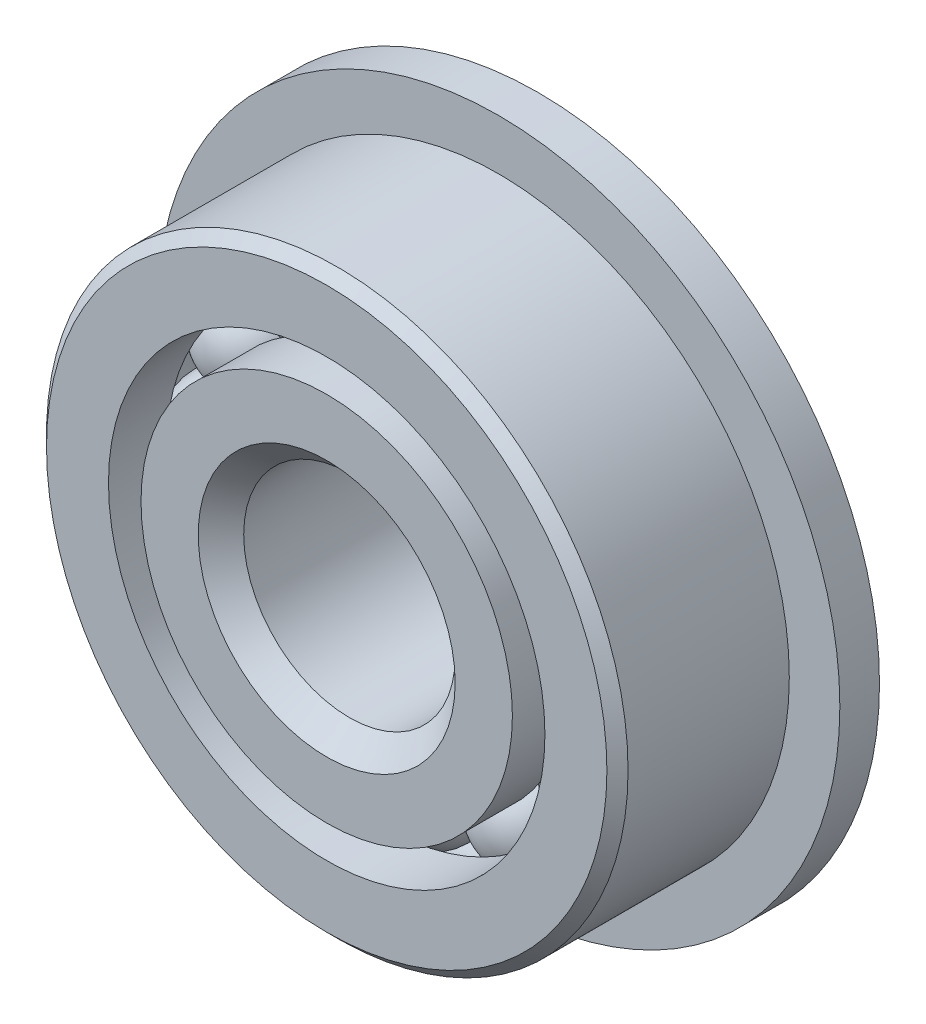
ISO-10303-21;
HEADER;
FILE_DESCRIPTION(('STEP AP214'),'2;1');
FILE_NAME('part.step','',(''),(''),'','','');
FILE_SCHEMA(('AUTOMOTIVE_DESIGN { 1 0 10303 214 1 1 1 1 }'));
ENDSEC;
DATA;
#1=APPLICATION_CONTEXT('core data for automotive mechanical design processes');
#2=APPLICATION_PROTOCOL_DEFINITION('international standard','automotive_design',2000,#1);
#3=PRODUCT_CONTEXT('',#1,'mechanical');
#4=PRODUCT('Part','Part','',(#3));
#5=PRODUCT_RELATED_PRODUCT_CATEGORY('part','',(#4));
#6=PRODUCT_DEFINITION_FORMATION('','',#4);
#7=PRODUCT_DEFINITION_CONTEXT('part definition',#1,'design');
#8=PRODUCT_DEFINITION('design','',#6,#7);
#9=PRODUCT_DEFINITION_SHAPE('','',#8);
#10=(LENGTH_UNIT() NAMED_UNIT(*) SI_UNIT(.MILLI.,.METRE.));
#11=(NAMED_UNIT(*) PLANE_ANGLE_UNIT() SI_UNIT($,.RADIAN.));
#12=(NAMED_UNIT(*) SI_UNIT($,.STERADIAN.) SOLID_ANGLE_UNIT());
#13=UNCERTAINTY_MEASURE_WITH_UNIT(LENGTH_MEASURE(1.E-05),#10,'distance_accuracy_value','');
#14=(GEOMETRIC_REPRESENTATION_CONTEXT(3) GLOBAL_UNCERTAINTY_ASSIGNED_CONTEXT((#13)) GLOBAL_UNIT_ASSIGNED_CONTEXT((#10,
#11,#12)) REPRESENTATION_CONTEXT('',''));
#15=CARTESIAN_POINT('',(0.,0.,0.));
#16=DIRECTION('',(0.,0.,1.));
#17=DIRECTION('',(1.,0.,0.));
#18=AXIS2_PLACEMENT_3D('',#15,#16,#17);
#19=CARTESIAN_POINT('',(-3.03212499999993,5.25179455489982,0.));
#20=DIRECTION('',(0.,0.,1.));
#21=DIRECTION('',(-0.499999999999989,0.866025403784445,0.));
#22=AXIS2_PLACEMENT_3D('',#19,#20,#21);
#23=SPHERICAL_SURFACE('',#22,1.524);
#24=CARTESIAN_POINT('',(-3.03212499999993,5.25179455489982,1.524));
#25=VERTEX_POINT('',#24);
#26=VERTEX_LOOP('',#25);
#27=FACE_BOUND('',#26,.T.);
#28=ADVANCED_FACE('F37',(#27),#23,.T.);
#29=CLOSED_SHELL('',(#28));
#30=MANIFOLD_SOLID_BREP('B2',#29);
#31=CARTESIAN_POINT('',(-5.25179455489975,3.03212500000006,0.));
#32=DIRECTION('',(0.,0.,1.));
#33=DIRECTION('',(-0.866025403784433,0.50000000000001,0.));
#34=AXIS2_PLACEMENT_3D('',#31,#32,#33);
#35=SPHERICAL_SURFACE('',#34,1.524);
#36=CARTESIAN_POINT('',(-5.25179455489975,3.03212500000006,1.524));
#37=VERTEX_POINT('',#36);
#38=VERTEX_LOOP('',#37);
#39=FACE_BOUND('',#38,.T.);
#40=ADVANCED_FACE('F58',(#39),#35,.T.);
#41=CLOSED_SHELL('',(#40));
#42=MANIFOLD_SOLID_BREP('B6',#41);
#43=CARTESIAN_POINT('',(-6.06425,0.,0.));
#44=DIRECTION('',(0.,0.,1.));
#45=DIRECTION('',(-1.,0.,0.));
#46=AXIS2_PLACEMENT_3D('',#43,#44,#45);
#47=SPHERICAL_SURFACE('',#46,1.524);
#48=CARTESIAN_POINT('',(-6.06425,0.,1.524));
#49=VERTEX_POINT('',#48);
#50=VERTEX_LOOP('',#49);
#51=FACE_BOUND('',#50,.T.);
#52=ADVANCED_FACE('F79',(#51),#47,.T.);
#53=CLOSED_SHELL('',(#52));
#54=MANIFOLD_SOLID_BREP('B33',#53);
#55=CARTESIAN_POINT('',(-5.25179455489981,-3.03212499999995,0.));
#56=DIRECTION('',(0.,0.,1.));
#57=DIRECTION('',(-0.866025403784443,-0.499999999999992,0.));
#58=AXIS2_PLACEMENT_3D('',#55,#56,#57);
#59=SPHERICAL_SURFACE('',#58,1.524);
#60=CARTESIAN_POINT('',(-5.25179455489981,-3.03212499999995,1.524));
#61=VERTEX_POINT('',#60);
#62=VERTEX_LOOP('',#61);
#63=FACE_BOUND('',#62,.T.);
#64=ADVANCED_FACE('F100',(#63),#59,.T.);
#65=CLOSED_SHELL('',(#64));
#66=MANIFOLD_SOLID_BREP('B54',#65);
#67=CARTESIAN_POINT('',(-3.03212500000004,-5.25179455489976,0.));
#68=DIRECTION('',(0.,0.,1.));
#69=DIRECTION('',(-0.500000000000007,-0.866025403784435,0.));
#70=AXIS2_PLACEMENT_3D('',#67,#68,#69);
#71=SPHERICAL_SURFACE('',#70,1.524);
#72=CARTESIAN_POINT('',(-3.03212500000004,-5.25179455489976,1.524));
#73=VERTEX_POINT('',#72);
#74=VERTEX_LOOP('',#73);
#75=FACE_BOUND('',#74,.T.);
#76=ADVANCED_FACE('F121',(#75),#71,.T.);
#77=CLOSED_SHELL('',(#76));
#78=MANIFOLD_SOLID_BREP('B75',#77);
#79=CARTESIAN_POINT('',(0.,-6.06425,0.));
#80=DIRECTION('',(0.,0.,1.));
#81=DIRECTION('',(0.,-1.,0.));
#82=AXIS2_PLACEMENT_3D('',#79,#80,#81);
#83=SPHERICAL_SURFACE('',#82,1.524);
#84=CARTESIAN_POINT('',(0.,-6.06425,1.524));
#85=VERTEX_POINT('',#84);
#86=VERTEX_LOOP('',#85);
#87=FACE_BOUND('',#86,.T.);
#88=ADVANCED_FACE('F142',(#87),#83,.T.);
#89=CLOSED_SHELL('',(#88));
#90=MANIFOLD_SOLID_BREP('B96',#89);
#91=CARTESIAN_POINT('',(3.03212499999997,-5.2517945548998,0.));
#92=DIRECTION('',(0.,0.,1.));
#93=DIRECTION('',(0.499999999999995,-0.866025403784442,0.));
#94=AXIS2_PLACEMENT_3D('',#91,#92,#93);
#95=SPHERICAL_SURFACE('',#94,1.524);
#96=CARTESIAN_POINT('',(3.03212499999997,-5.2517945548998,1.524));
#97=VERTEX_POINT('',#96);
#98=VERTEX_LOOP('',#97);
#99=FACE_BOUND('',#98,.T.);
#100=ADVANCED_FACE('F163',(#99),#95,.T.);
#101=CLOSED_SHELL('',(#100));
#102=MANIFOLD_SOLID_BREP('B117',#101);
#103=CARTESIAN_POINT('',(5.25179455489977,-3.03212500000002,0.));
#104=DIRECTION('',(0.,0.,1.));
#105=DIRECTION('',(0.866025403784436,-0.500000000000004,0.));
#106=AXIS2_PLACEMENT_3D('',#103,#104,#105);
#107=SPHERICAL_SURFACE('',#106,1.524);
#108=CARTESIAN_POINT('',(5.25179455489977,-3.03212500000002,1.524));
#109=VERTEX_POINT('',#108);
#110=VERTEX_LOOP('',#109);
#111=FACE_BOUND('',#110,.T.);
#112=ADVANCED_FACE('F184',(#111),#107,.T.);
#113=CLOSED_SHELL('',(#112));
#114=MANIFOLD_SOLID_BREP('B138',#113);
#115=CARTESIAN_POINT('',(6.06425,0.,0.));
#116=DIRECTION('',(0.,0.,1.));
#117=DIRECTION('',(1.,0.,0.));
#118=AXIS2_PLACEMENT_3D('',#115,#116,#117);
#119=SPHERICAL_SURFACE('',#118,1.524);
#120=CARTESIAN_POINT('',(6.06425,0.,1.524));
#121=VERTEX_POINT('',#120);
#122=VERTEX_LOOP('',#121);
#123=FACE_BOUND('',#122,.T.);
#124=ADVANCED_FACE('F205',(#123),#119,.T.);
#125=CLOSED_SHELL('',(#124));
#126=MANIFOLD_SOLID_BREP('B159',#125);
#127=CARTESIAN_POINT('',(5.25179455489979,3.03212499999999,0.));
#128=DIRECTION('',(0.,0.,1.));
#129=DIRECTION('',(0.86602540378444,0.499999999999998,0.));
#130=AXIS2_PLACEMENT_3D('',#127,#128,#129);
#131=SPHERICAL_SURFACE('',#130,1.524);
#132=CARTESIAN_POINT('',(5.25179455489979,3.03212499999999,1.524));
#133=VERTEX_POINT('',#132);
#134=VERTEX_LOOP('',#133);
#135=FACE_BOUND('',#134,.T.);
#136=ADVANCED_FACE('F226',(#135),#131,.T.);
#137=CLOSED_SHELL('',(#136));
#138=MANIFOLD_SOLID_BREP('B180',#137);
#139=CARTESIAN_POINT('',(3.03212500000001,5.25179455489978,0.));
#140=DIRECTION('',(0.,0.,1.));
#141=DIRECTION('',(0.500000000000001,0.866025403784438,0.));
#142=AXIS2_PLACEMENT_3D('',#139,#140,#141);
#143=SPHERICAL_SURFACE('',#142,1.524);
#144=CARTESIAN_POINT('',(3.03212500000001,5.25179455489978,1.524));
#145=VERTEX_POINT('',#144);
#146=VERTEX_LOOP('',#145);
#147=FACE_BOUND('',#146,.T.);
#148=ADVANCED_FACE('F247',(#147),#143,.T.);
#149=CLOSED_SHELL('',(#148));
#150=MANIFOLD_SOLID_BREP('B201',#149);
#151=CARTESIAN_POINT('',(0.,6.06425,0.));
#152=DIRECTION('',(0.,0.,1.));
#153=DIRECTION('',(0.,1.,0.));
#154=AXIS2_PLACEMENT_3D('',#151,#152,#153);
#155=SPHERICAL_SURFACE('',#154,1.524);
#156=CARTESIAN_POINT('',(0.,6.06425,1.524));
#157=VERTEX_POINT('',#156);
#158=VERTEX_LOOP('',#157);
#159=FACE_BOUND('',#158,.T.);
#160=ADVANCED_FACE('F269',(#159),#155,.T.);
#161=CLOSED_SHELL('',(#160));
#162=MANIFOLD_SOLID_BREP('B222',#161);
#163=CARTESIAN_POINT('',(0.,0.,3.175));
#164=DIRECTION('',(0.,0.,1.));
#165=DIRECTION('',(1.,0.,0.));
#166=AXIS2_PLACEMENT_3D('',#163,#164,#165);
#167=CYLINDRICAL_SURFACE('',#166,5.57578846153846);
#168=CARTESIAN_POINT('',(0.,0.,-1.44360012657376));
#169=DIRECTION('',(0.,0.,1.));
#170=DIRECTION('',(1.,0.,0.));
#171=AXIS2_PLACEMENT_3D('',#168,#169,#170);
#172=CIRCLE('',#171,5.57578846153846);
#173=CARTESIAN_POINT('',(5.57578846153846,0.,-1.44360012657376));
#174=VERTEX_POINT('',#173);
#175=EDGE_CURVE('E300',#174,#174,#172,.T.);
#176=ORIENTED_EDGE('',*,*,#175,.F.);
#177=EDGE_LOOP('',(#176));
#178=FACE_BOUND('',#177,.T.);
#179=CARTESIAN_POINT('',(0.,0.,-4.7625));
#180=DIRECTION('',(0.,0.,1.));
#181=DIRECTION('',(1.,0.,0.));
#182=AXIS2_PLACEMENT_3D('',#179,#180,#181);
#183=CIRCLE('',#182,5.57578846153846);
#184=CARTESIAN_POINT('',(5.57578846153846,0.,-4.7625));
#185=VERTEX_POINT('',#184);
#186=EDGE_CURVE('E304',#185,#185,#183,.T.);
#187=ORIENTED_EDGE('',*,*,#186,.T.);
#188=EDGE_LOOP('',(#187));
#189=FACE_BOUND('',#188,.T.);
#190=ADVANCED_FACE('F289',(#178,#189),#167,.T.);
#191=CARTESIAN_POINT('',(0.,3.4925,-4.7625));
#192=DIRECTION('',(0.,0.,1.));
#193=DIRECTION('',(1.,0.,0.));
#194=AXIS2_PLACEMENT_3D('',#191,#192,#193);
#195=PLANE('',#194);
#196=ORIENTED_EDGE('',*,*,#186,.F.);
#197=EDGE_LOOP('',(#196));
#198=FACE_BOUND('',#197,.T.);
#199=CARTESIAN_POINT('',(0.,0.,-4.7625));
#200=DIRECTION('',(0.,0.,1.));
#201=DIRECTION('',(1.,0.,0.));
#202=AXIS2_PLACEMENT_3D('',#199,#200,#201);
#203=CIRCLE('',#202,3.4925);
#204=CARTESIAN_POINT('',(3.4925,0.,-4.7625));
#205=VERTEX_POINT('',#204);
#206=EDGE_CURVE('E309',#205,#205,#203,.T.);
#207=ORIENTED_EDGE('',*,*,#206,.T.);
#208=EDGE_LOOP('',(#207));
#209=FACE_BOUND('',#208,.T.);
#210=ADVANCED_FACE('F336',(#198,#209),#195,.F.);
#211=CARTESIAN_POINT('',(0.,0.,-4.445));
#212=DIRECTION('',(0.,0.,-1.));
#213=DIRECTION('',(-1.,0.,0.));
#214=AXIS2_PLACEMENT_3D('',#211,#212,#213);
#215=CONICAL_SURFACE('',#214,3.175,0.785398163397443);
#216=ORIENTED_EDGE('',*,*,#206,.F.);
#217=EDGE_LOOP('',(#216));
#218=FACE_BOUND('',#217,.T.);
#219=CARTESIAN_POINT('',(0.,0.,-4.445));
#220=DIRECTION('',(0.,0.,1.));
#221=DIRECTION('',(1.,0.,0.));
#222=AXIS2_PLACEMENT_3D('',#219,#220,#221);
#223=CIRCLE('',#222,3.175);
#224=CARTESIAN_POINT('',(3.175,0.,-4.445));
#225=VERTEX_POINT('',#224);
#226=EDGE_CURVE('E312',#225,#225,#223,.T.);
#227=ORIENTED_EDGE('',*,*,#226,.T.);
#228=EDGE_LOOP('',(#227));
#229=FACE_BOUND('',#228,.T.);
#230=ADVANCED_FACE('F342',(#218,#229),#215,.F.);
#231=CARTESIAN_POINT('',(0.,0.,3.175));
#232=DIRECTION('',(0.,0.,1.));
#233=DIRECTION('',(1.,0.,0.));
#234=AXIS2_PLACEMENT_3D('',#231,#232,#233);
#235=CYLINDRICAL_SURFACE('',#234,3.175);
#236=ORIENTED_EDGE('',*,*,#226,.F.);
#237=EDGE_LOOP('',(#236));
#238=FACE_BOUND('',#237,.T.);
#239=CARTESIAN_POINT('',(0.,0.,2.492375));
#240=DIRECTION('',(0.,0.,1.));
#241=DIRECTION('',(1.,0.,0.));
#242=AXIS2_PLACEMENT_3D('',#239,#240,#241);
#243=CIRCLE('',#242,3.175);
#244=CARTESIAN_POINT('',(3.175,0.,2.492375));
#245=VERTEX_POINT('',#244);
#246=EDGE_CURVE('E315',#245,#245,#243,.T.);
#247=ORIENTED_EDGE('',*,*,#246,.T.);
#248=EDGE_LOOP('',(#247));
#249=FACE_BOUND('',#248,.T.);
#250=ADVANCED_FACE('F332',(#238,#249),#235,.F.);
#251=CARTESIAN_POINT('',(0.,0.,3.175));
#252=DIRECTION('',(0.,0.,1.));
#253=DIRECTION('',(1.,0.,0.));
#254=AXIS2_PLACEMENT_3D('',#251,#252,#253);
#255=CONICAL_SURFACE('',#254,3.857625,0.78539816339745);
#256=ORIENTED_EDGE('',*,*,#246,.F.);
#257=EDGE_LOOP('',(#256));
#258=FACE_BOUND('',#257,.T.);
#259=CARTESIAN_POINT('',(0.,0.,3.175));
#260=DIRECTION('',(0.,0.,1.));
#261=DIRECTION('',(1.,0.,0.));
#262=AXIS2_PLACEMENT_3D('',#259,#260,#261);
#263=CIRCLE('',#262,3.857625);
#264=CARTESIAN_POINT('',(3.857625,0.,3.175));
#265=VERTEX_POINT('',#264);
#266=EDGE_CURVE('E318',#265,#265,#263,.T.);
#267=ORIENTED_EDGE('',*,*,#266,.T.);
#268=EDGE_LOOP('',(#267));
#269=FACE_BOUND('',#268,.T.);
#270=ADVANCED_FACE('F322',(#258,#269),#255,.F.);
#271=CARTESIAN_POINT('',(0.,5.57578846153846,3.175));
#272=DIRECTION('',(0.,0.,-1.));
#273=DIRECTION('',(-1.,0.,0.));
#274=AXIS2_PLACEMENT_3D('',#271,#272,#273);
#275=PLANE('',#274);
#276=CARTESIAN_POINT('',(0.,0.,3.175));
#277=DIRECTION('',(0.,0.,1.));
#278=DIRECTION('',(1.,0.,0.));
#279=AXIS2_PLACEMENT_3D('',#276,#277,#278);
#280=CIRCLE('',#279,5.57578846153846);
#281=CARTESIAN_POINT('',(5.57578846153846,0.,3.175));
#282=VERTEX_POINT('',#281);
#283=EDGE_CURVE('E296',#282,#282,#280,.T.);
#284=ORIENTED_EDGE('',*,*,#283,.T.);
#285=EDGE_LOOP('',(#284));
#286=FACE_BOUND('',#285,.T.);
#287=ORIENTED_EDGE('',*,*,#266,.F.);
#288=EDGE_LOOP('',(#287));
#289=FACE_BOUND('',#288,.T.);
#290=ADVANCED_FACE('F291',(#286,#289),#275,.F.);
#291=CARTESIAN_POINT('',(0.,0.,0.));
#292=DIRECTION('',(0.,0.,1.));
#293=DIRECTION('',(1.,0.,0.));
#294=AXIS2_PLACEMENT_3D('',#291,#292,#293);
#295=TOROIDAL_SURFACE('',#294,6.06425,1.524);
#296=CARTESIAN_POINT('',(0.,0.,1.44360012657376));
#297=DIRECTION('',(0.,0.,1.));
#298=DIRECTION('',(1.,0.,0.));
#299=AXIS2_PLACEMENT_3D('',#296,#297,#298);
#300=CIRCLE('',#299,5.57578846153846);
#301=CARTESIAN_POINT('',(5.57578846153846,0.,1.44360012657376));
#302=VERTEX_POINT('',#301);
#303=EDGE_CURVE('E268',#302,#302,#300,.T.);
#304=ORIENTED_EDGE('',*,*,#303,.F.);
#305=EDGE_LOOP('',(#304));
#306=FACE_BOUND('',#305,.T.);
#307=ORIENTED_EDGE('',*,*,#175,.T.);
#308=EDGE_LOOP('',(#307));
#309=FACE_BOUND('',#308,.T.);
#310=ADVANCED_FACE('F325',(#306,#309),#295,.F.);
#311=CARTESIAN_POINT('',(0.,0.,3.175));
#312=DIRECTION('',(0.,0.,1.));
#313=DIRECTION('',(1.,0.,0.));
#314=AXIS2_PLACEMENT_3D('',#311,#312,#313);
#315=CYLINDRICAL_SURFACE('',#314,5.57578846153846);
#316=ORIENTED_EDGE('',*,*,#283,.F.);
#317=EDGE_LOOP('',(#316));
#318=FACE_BOUND('',#317,.T.);
#319=ORIENTED_EDGE('',*,*,#303,.T.);
#320=EDGE_LOOP('',(#319));
#321=FACE_BOUND('',#320,.T.);
#322=ADVANCED_FACE('F330',(#318,#321),#315,.T.);
#323=CLOSED_SHELL('',(#190,#210,#230,#250,#270,#290,#310,#322));
#324=MANIFOLD_SOLID_BREP('B243',#323);
#325=CARTESIAN_POINT('',(0.,0.,2.8575));
#326=DIRECTION('',(0.,0.,-1.));
#327=DIRECTION('',(-1.,0.,0.));
#328=AXIS2_PLACEMENT_3D('',#325,#326,#327);
#329=CONICAL_SURFACE('',#328,8.73125,0.785398163397446);
#330=CARTESIAN_POINT('',(0.,0.,3.175));
#331=DIRECTION('',(0.,0.,1.));
#332=DIRECTION('',(1.,0.,0.));
#333=AXIS2_PLACEMENT_3D('',#330,#331,#332);
#334=CIRCLE('',#333,8.41375);
#335=CARTESIAN_POINT('',(8.41375,0.,3.175));
#336=VERTEX_POINT('',#335);
#337=EDGE_CURVE('E439',#336,#336,#334,.T.);
#338=ORIENTED_EDGE('',*,*,#337,.F.);
#339=EDGE_LOOP('',(#338));
#340=FACE_BOUND('',#339,.T.);
#341=CARTESIAN_POINT('',(0.,0.,2.8575));
#342=DIRECTION('',(0.,0.,1.));
#343=DIRECTION('',(1.,0.,0.));
#344=AXIS2_PLACEMENT_3D('',#341,#342,#343);
#345=CIRCLE('',#344,8.73125);
#346=CARTESIAN_POINT('',(8.73125,0.,2.8575));
#347=VERTEX_POINT('',#346);
#348=EDGE_CURVE('E288',#347,#347,#345,.T.);
#349=ORIENTED_EDGE('',*,*,#348,.T.);
#350=EDGE_LOOP('',(#349));
#351=FACE_BOUND('',#350,.T.);
#352=ADVANCED_FACE('F417',(#340,#351),#329,.T.);
#353=CARTESIAN_POINT('',(0.,0.,3.175));
#354=DIRECTION('',(0.,0.,1.));
#355=DIRECTION('',(1.,0.,0.));
#356=AXIS2_PLACEMENT_3D('',#353,#354,#355);
#357=CYLINDRICAL_SURFACE('',#356,8.73125);
#358=CARTESIAN_POINT('',(0.,0.,-1.984375));
#359=DIRECTION('',(0.,0.,1.));
#360=DIRECTION('',(1.,0.,0.));
#361=AXIS2_PLACEMENT_3D('',#358,#359,#360);
#362=CIRCLE('',#361,8.73125);
#363=CARTESIAN_POINT('',(8.73125,0.,-1.984375));
#364=VERTEX_POINT('',#363);
#365=EDGE_CURVE('E420',#364,#364,#362,.T.);
#366=ORIENTED_EDGE('',*,*,#365,.T.);
#367=EDGE_LOOP('',(#366));
#368=FACE_BOUND('',#367,.T.);
#369=ORIENTED_EDGE('',*,*,#348,.F.);
#370=EDGE_LOOP('',(#369));
#371=FACE_BOUND('',#370,.T.);
#372=ADVANCED_FACE('F460',(#368,#371),#357,.T.);
#373=CARTESIAN_POINT('',(0.,8.41375,-3.175));
#374=DIRECTION('',(0.,0.,1.));
#375=DIRECTION('',(1.,0.,0.));
#376=AXIS2_PLACEMENT_3D('',#373,#374,#375);
#377=PLANE('',#376);
#378=CARTESIAN_POINT('',(0.,0.,-3.175));
#379=DIRECTION('',(0.,0.,1.));
#380=DIRECTION('',(1.,0.,0.));
#381=AXIS2_PLACEMENT_3D('',#378,#379,#380);
#382=CIRCLE('',#381,6.55271153846154);
#383=CARTESIAN_POINT('',(6.55271153846154,0.,-3.175));
#384=VERTEX_POINT('',#383);
#385=EDGE_CURVE('E424',#384,#384,#382,.T.);
#386=ORIENTED_EDGE('',*,*,#385,.T.);
#387=EDGE_LOOP('',(#386));
#388=FACE_BOUND('',#387,.T.);
#389=CARTESIAN_POINT('',(0.,0.,-3.175));
#390=DIRECTION('',(0.,0.,-1.));
#391=DIRECTION('',(-1.,0.,0.));
#392=AXIS2_PLACEMENT_3D('',#389,#390,#391);
#393=CIRCLE('',#392,10.2489);
#394=CARTESIAN_POINT('',(-10.2489,0.,-3.175));
#395=VERTEX_POINT('',#394);
#396=EDGE_CURVE('E442',#395,#395,#393,.T.);
#397=ORIENTED_EDGE('',*,*,#396,.T.);
#398=EDGE_LOOP('',(#397));
#399=FACE_BOUND('',#398,.T.);
#400=ADVANCED_FACE('F463',(#388,#399),#377,.F.);
#401=CARTESIAN_POINT('',(0.,0.,3.175));
#402=DIRECTION('',(0.,0.,1.));
#403=DIRECTION('',(1.,0.,0.));
#404=AXIS2_PLACEMENT_3D('',#401,#402,#403);
#405=CYLINDRICAL_SURFACE('',#404,6.55271153846154);
#406=ORIENTED_EDGE('',*,*,#385,.F.);
#407=EDGE_LOOP('',(#406));
#408=FACE_BOUND('',#407,.T.);
#409=CARTESIAN_POINT('',(0.,0.,-1.44360012657376));
#410=DIRECTION('',(0.,0.,1.));
#411=DIRECTION('',(1.,0.,0.));
#412=AXIS2_PLACEMENT_3D('',#409,#410,#411);
#413=CIRCLE('',#412,6.55271153846154);
#414=CARTESIAN_POINT('',(6.55271153846154,0.,-1.44360012657376));
#415=VERTEX_POINT('',#414);
#416=EDGE_CURVE('E428',#415,#415,#413,.T.);
#417=ORIENTED_EDGE('',*,*,#416,.T.);
#418=EDGE_LOOP('',(#417));
#419=FACE_BOUND('',#418,.T.);
#420=ADVANCED_FACE('F468',(#408,#419),#405,.F.);
#421=CARTESIAN_POINT('',(0.,0.,0.));
#422=DIRECTION('',(0.,0.,1.));
#423=DIRECTION('',(1.,0.,0.));
#424=AXIS2_PLACEMENT_3D('',#421,#422,#423);
#425=TOROIDAL_SURFACE('',#424,6.06425,1.524);
#426=ORIENTED_EDGE('',*,*,#416,.F.);
#427=EDGE_LOOP('',(#426));
#428=FACE_BOUND('',#427,.T.);
#429=CARTESIAN_POINT('',(0.,0.,1.44360012657376));
#430=DIRECTION('',(0.,0.,1.));
#431=DIRECTION('',(1.,0.,0.));
#432=AXIS2_PLACEMENT_3D('',#429,#430,#431);
#433=CIRCLE('',#432,6.55271153846154);
#434=CARTESIAN_POINT('',(6.55271153846154,0.,1.44360012657376));
#435=VERTEX_POINT('',#434);
#436=EDGE_CURVE('E433',#435,#435,#433,.T.);
#437=ORIENTED_EDGE('',*,*,#436,.T.);
#438=EDGE_LOOP('',(#437));
#439=FACE_BOUND('',#438,.T.);
#440=ADVANCED_FACE('F475',(#428,#439),#425,.F.);
#441=CARTESIAN_POINT('',(0.,0.,3.175));
#442=DIRECTION('',(0.,0.,1.));
#443=DIRECTION('',(1.,0.,0.));
#444=AXIS2_PLACEMENT_3D('',#441,#442,#443);
#445=CYLINDRICAL_SURFACE('',#444,6.55271153846154);
#446=ORIENTED_EDGE('',*,*,#436,.F.);
#447=EDGE_LOOP('',(#446));
#448=FACE_BOUND('',#447,.T.);
#449=CARTESIAN_POINT('',(0.,0.,3.175));
#450=DIRECTION('',(0.,0.,1.));
#451=DIRECTION('',(1.,0.,0.));
#452=AXIS2_PLACEMENT_3D('',#449,#450,#451);
#453=CIRCLE('',#452,6.55271153846154);
#454=CARTESIAN_POINT('',(6.55271153846154,0.,3.175));
#455=VERTEX_POINT('',#454);
#456=EDGE_CURVE('E436',#455,#455,#453,.T.);
#457=ORIENTED_EDGE('',*,*,#456,.T.);
#458=EDGE_LOOP('',(#457));
#459=FACE_BOUND('',#458,.T.);
#460=ADVANCED_FACE('F479',(#448,#459),#445,.F.);
#461=CARTESIAN_POINT('',(0.,8.41375,3.175));
#462=DIRECTION('',(0.,0.,-1.));
#463=DIRECTION('',(-1.,0.,0.));
#464=AXIS2_PLACEMENT_3D('',#461,#462,#463);
#465=PLANE('',#464);
#466=ORIENTED_EDGE('',*,*,#456,.F.);
#467=EDGE_LOOP('',(#466));
#468=FACE_BOUND('',#467,.T.);
#469=ORIENTED_EDGE('',*,*,#337,.T.);
#470=EDGE_LOOP('',(#469));
#471=FACE_BOUND('',#470,.T.);
#472=ADVANCED_FACE('F455',(#468,#471),#465,.F.);
#473=CARTESIAN_POINT('',(0.,7.48323076923077,-1.984375));
#474=DIRECTION('',(0.,0.,1.));
#475=DIRECTION('',(1.,0.,0.));
#476=AXIS2_PLACEMENT_3D('',#473,#474,#475);
#477=PLANE('',#476);
#478=CARTESIAN_POINT('',(0.,0.,-1.984375));
#479=DIRECTION('',(0.,0.,-1.));
#480=DIRECTION('',(-1.,0.,0.));
#481=AXIS2_PLACEMENT_3D('',#478,#479,#480);
#482=CIRCLE('',#481,10.2489);
#483=CARTESIAN_POINT('',(-10.2489,0.,-1.984375));
#484=VERTEX_POINT('',#483);
#485=EDGE_CURVE('E445',#484,#484,#482,.T.);
#486=ORIENTED_EDGE('',*,*,#485,.F.);
#487=EDGE_LOOP('',(#486));
#488=FACE_BOUND('',#487,.T.);
#489=ORIENTED_EDGE('',*,*,#365,.F.);
#490=EDGE_LOOP('',(#489));
#491=FACE_BOUND('',#490,.T.);
#492=ADVANCED_FACE('F452',(#488,#491),#477,.T.);
#493=CARTESIAN_POINT('',(0.,0.,-4.7625));
#494=DIRECTION('',(0.,0.,-1.));
#495=DIRECTION('',(-1.,0.,0.));
#496=AXIS2_PLACEMENT_3D('',#493,#494,#495);
#497=CYLINDRICAL_SURFACE('',#496,10.2489);
#498=ORIENTED_EDGE('',*,*,#485,.T.);
#499=EDGE_LOOP('',(#498));
#500=FACE_BOUND('',#499,.T.);
#501=ORIENTED_EDGE('',*,*,#396,.F.);
#502=EDGE_LOOP('',(#501));
#503=FACE_BOUND('',#502,.T.);
#504=ADVANCED_FACE('F449',(#500,#503),#497,.T.);
#505=CLOSED_SHELL('',(#352,#372,#400,#420,#440,#460,#472,#492,#504));
#506=MANIFOLD_SOLID_BREP('B263',#505);
#507=ADVANCED_BREP_SHAPE_REPRESENTATION('',(#18,#30,#42,#54,#66,#78,#90,#102,#114,#126,#138,
#150,#162,#324,#506),#14);
#508=SHAPE_DEFINITION_REPRESENTATION(#9,#507);
ENDSEC;
END-ISO-10303-21;
